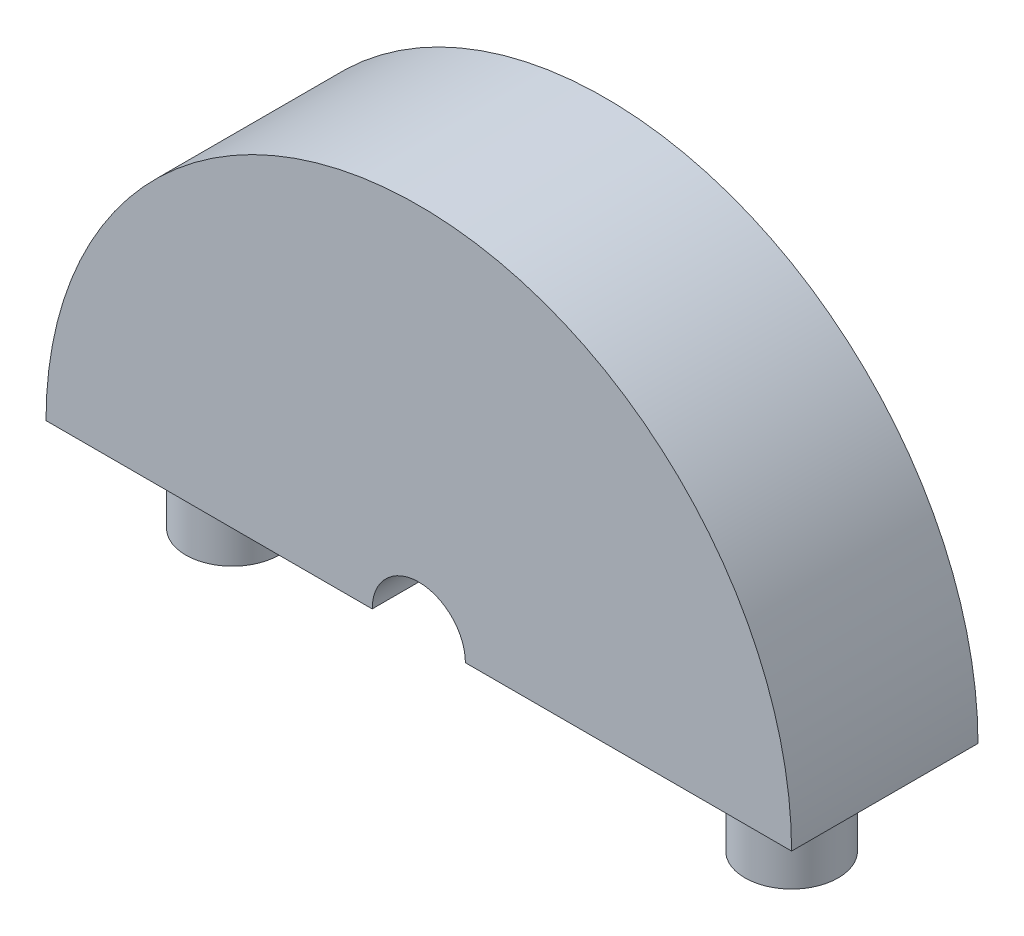
ISO-10303-21;
HEADER;
FILE_DESCRIPTION(('STEP AP214'),'2;1');
FILE_NAME('part.step','',(''),(''),'','','');
FILE_SCHEMA(('AUTOMOTIVE_DESIGN { 1 0 10303 214 1 1 1 1 }'));
ENDSEC;
DATA;
#1=APPLICATION_CONTEXT('core data for automotive mechanical design processes');
#2=APPLICATION_PROTOCOL_DEFINITION('international standard','automotive_design',2000,#1);
#3=PRODUCT_CONTEXT('',#1,'mechanical');
#4=PRODUCT('Part','Part','',(#3));
#5=PRODUCT_RELATED_PRODUCT_CATEGORY('part','',(#4));
#6=PRODUCT_DEFINITION_FORMATION('','',#4);
#7=PRODUCT_DEFINITION_CONTEXT('part definition',#1,'design');
#8=PRODUCT_DEFINITION('design','',#6,#7);
#9=PRODUCT_DEFINITION_SHAPE('','',#8);
#10=(LENGTH_UNIT() NAMED_UNIT(*) SI_UNIT(.MILLI.,.METRE.));
#11=(NAMED_UNIT(*) PLANE_ANGLE_UNIT() SI_UNIT($,.RADIAN.));
#12=(NAMED_UNIT(*) SI_UNIT($,.STERADIAN.) SOLID_ANGLE_UNIT());
#13=UNCERTAINTY_MEASURE_WITH_UNIT(LENGTH_MEASURE(1.E-05),#10,'distance_accuracy_value','');
#14=(GEOMETRIC_REPRESENTATION_CONTEXT(3) GLOBAL_UNCERTAINTY_ASSIGNED_CONTEXT((#13)) GLOBAL_UNIT_ASSIGNED_CONTEXT((#10,
#11,#12)) REPRESENTATION_CONTEXT('',''));
#15=CARTESIAN_POINT('',(0.,0.,0.));
#16=DIRECTION('',(0.,0.,1.));
#17=DIRECTION('',(1.,0.,0.));
#18=AXIS2_PLACEMENT_3D('',#15,#16,#17);
#19=CARTESIAN_POINT('',(20.,0.,10.));
#20=DIRECTION('',(0.,1.,0.));
#21=DIRECTION('',(0.,0.,1.));
#22=AXIS2_PLACEMENT_3D('',#19,#20,#21);
#23=PLANE('',#22);
#24=CARTESIAN_POINT('',(-15.,0.,5.));
#25=DIRECTION('',(0.,1.,0.));
#26=DIRECTION('',(0.,0.,1.));
#27=AXIS2_PLACEMENT_3D('',#24,#25,#26);
#28=CIRCLE('',#27,2.5);
#29=CARTESIAN_POINT('',(-15.,0.,7.5));
#30=VERTEX_POINT('',#29);
#31=EDGE_CURVE('E41',#30,#30,#28,.F.);
#32=ORIENTED_EDGE('',*,*,#31,.F.);
#33=EDGE_LOOP('',(#32));
#34=FACE_BOUND('',#33,.T.);
#35=DIRECTION('',(0.,0.,1.));
#36=VECTOR('',#35,1.);
#37=CARTESIAN_POINT('',(-2.5,0.,17.1339099450869));
#38=LINE('',#37,#36);
#39=CARTESIAN_POINT('',(-2.5,0.,10.));
#40=VERTEX_POINT('',#39);
#41=CARTESIAN_POINT('',(-2.5,0.,0.));
#42=VERTEX_POINT('',#41);
#43=EDGE_CURVE('E48',#40,#42,#38,.F.);
#44=ORIENTED_EDGE('',*,*,#43,.F.);
#45=DIRECTION('',(1.,0.,0.));
#46=VECTOR('',#45,1.);
#47=CARTESIAN_POINT('',(20.,0.,10.));
#48=LINE('',#47,#46);
#49=CARTESIAN_POINT('',(-20.,0.,10.));
#50=VERTEX_POINT('',#49);
#51=EDGE_CURVE('E88',#50,#40,#48,.T.);
#52=ORIENTED_EDGE('',*,*,#51,.F.);
#53=DIRECTION('',(0.,0.,-1.));
#54=VECTOR('',#53,1.);
#55=CARTESIAN_POINT('',(-20.,0.,10.));
#56=LINE('',#55,#54);
#57=CARTESIAN_POINT('',(-20.,0.,0.));
#58=VERTEX_POINT('',#57);
#59=EDGE_CURVE('E87',#50,#58,#56,.T.);
#60=ORIENTED_EDGE('',*,*,#59,.T.);
#61=DIRECTION('',(1.,0.,0.));
#62=VECTOR('',#61,1.);
#63=CARTESIAN_POINT('',(20.,0.,0.));
#64=LINE('',#63,#62);
#65=EDGE_CURVE('E80',#58,#42,#64,.T.);
#66=ORIENTED_EDGE('',*,*,#65,.T.);
#67=EDGE_LOOP('',(#44,#52,#60,#66));
#68=FACE_BOUND('',#67,.T.);
#69=ADVANCED_FACE('F33',(#34,#68),#23,.F.);
#70=CARTESIAN_POINT('',(15.,0.,5.));
#71=DIRECTION('',(0.,1.,0.));
#72=DIRECTION('',(0.,0.,1.));
#73=AXIS2_PLACEMENT_3D('',#70,#71,#72);
#74=CIRCLE('',#73,2.5);
#75=CARTESIAN_POINT('',(15.,0.,7.5));
#76=VERTEX_POINT('',#75);
#77=EDGE_CURVE('E11',#76,#76,#74,.F.);
#78=ORIENTED_EDGE('',*,*,#77,.F.);
#79=EDGE_LOOP('',(#78));
#80=FACE_BOUND('',#79,.T.);
#81=DIRECTION('',(0.,0.,1.));
#82=VECTOR('',#81,1.);
#83=CARTESIAN_POINT('',(2.5,0.,17.1339099450869));
#84=LINE('',#83,#82);
#85=CARTESIAN_POINT('',(2.5,0.,0.));
#86=VERTEX_POINT('',#85);
#87=CARTESIAN_POINT('',(2.5,0.,10.));
#88=VERTEX_POINT('',#87);
#89=EDGE_CURVE('E77',#86,#88,#84,.T.);
#90=ORIENTED_EDGE('',*,*,#89,.F.);
#91=CARTESIAN_POINT('',(20.,0.,0.));
#92=VERTEX_POINT('',#91);
#93=EDGE_CURVE('E71',#86,#92,#64,.T.);
#94=ORIENTED_EDGE('',*,*,#93,.T.);
#95=DIRECTION('',(0.,0.,-1.));
#96=VECTOR('',#95,1.);
#97=CARTESIAN_POINT('',(20.,0.,10.));
#98=LINE('',#97,#96);
#99=CARTESIAN_POINT('',(20.,0.,10.));
#100=VERTEX_POINT('',#99);
#101=EDGE_CURVE('E74',#100,#92,#98,.T.);
#102=ORIENTED_EDGE('',*,*,#101,.F.);
#103=EDGE_CURVE('E57',#88,#100,#48,.T.);
#104=ORIENTED_EDGE('',*,*,#103,.F.);
#105=EDGE_LOOP('',(#90,#94,#102,#104));
#106=FACE_BOUND('',#105,.T.);
#107=ADVANCED_FACE('F73',(#80,#106),#23,.F.);
#108=CARTESIAN_POINT('',(0.,0.,10.));
#109=DIRECTION('',(0.,0.,-1.));
#110=DIRECTION('',(-1.,0.,0.));
#111=AXIS2_PLACEMENT_3D('',#108,#109,#110);
#112=CYLINDRICAL_SURFACE('',#111,20.);
#113=CARTESIAN_POINT('',(0.,0.,0.));
#114=DIRECTION('',(0.,0.,1.));
#115=DIRECTION('',(1.,0.,0.));
#116=AXIS2_PLACEMENT_3D('',#113,#114,#115);
#117=CIRCLE('',#116,20.);
#118=EDGE_CURVE('E81',#92,#58,#117,.T.);
#119=ORIENTED_EDGE('',*,*,#118,.T.);
#120=ORIENTED_EDGE('',*,*,#59,.F.);
#121=CARTESIAN_POINT('',(0.,0.,10.));
#122=DIRECTION('',(0.,0.,1.));
#123=DIRECTION('',(1.,0.,0.));
#124=AXIS2_PLACEMENT_3D('',#121,#122,#123);
#125=CIRCLE('',#124,20.);
#126=EDGE_CURVE('E86',#100,#50,#125,.T.);
#127=ORIENTED_EDGE('',*,*,#126,.F.);
#128=ORIENTED_EDGE('',*,*,#101,.T.);
#129=EDGE_LOOP('',(#119,#120,#127,#128));
#130=FACE_BOUND('',#129,.T.);
#131=ADVANCED_FACE('F35',(#130),#112,.T.);
#132=CARTESIAN_POINT('',(0.,0.,10.));
#133=DIRECTION('',(0.,0.,1.));
#134=DIRECTION('',(1.,0.,0.));
#135=AXIS2_PLACEMENT_3D('',#132,#133,#134);
#136=PLANE('',#135);
#137=ORIENTED_EDGE('',*,*,#51,.T.);
#138=CARTESIAN_POINT('',(0.,0.,10.));
#139=DIRECTION('',(0.,0.,1.));
#140=DIRECTION('',(1.,0.,0.));
#141=AXIS2_PLACEMENT_3D('',#138,#139,#140);
#142=CIRCLE('',#141,2.5);
#143=EDGE_CURVE('E110',#88,#40,#142,.T.);
#144=ORIENTED_EDGE('',*,*,#143,.F.);
#145=ORIENTED_EDGE('',*,*,#103,.T.);
#146=ORIENTED_EDGE('',*,*,#126,.T.);
#147=EDGE_LOOP('',(#137,#144,#145,#146));
#148=FACE_BOUND('',#147,.T.);
#149=ADVANCED_FACE('F109',(#148),#136,.T.);
#150=CARTESIAN_POINT('',(0.,0.,0.));
#151=DIRECTION('',(0.,0.,1.));
#152=DIRECTION('',(1.,0.,0.));
#153=AXIS2_PLACEMENT_3D('',#150,#151,#152);
#154=PLANE('',#153);
#155=CARTESIAN_POINT('',(0.,0.,0.));
#156=DIRECTION('',(0.,0.,1.));
#157=DIRECTION('',(1.,0.,0.));
#158=AXIS2_PLACEMENT_3D('',#155,#156,#157);
#159=CIRCLE('',#158,2.5);
#160=EDGE_CURVE('E114',#86,#42,#159,.T.);
#161=ORIENTED_EDGE('',*,*,#160,.T.);
#162=ORIENTED_EDGE('',*,*,#65,.F.);
#163=ORIENTED_EDGE('',*,*,#118,.F.);
#164=ORIENTED_EDGE('',*,*,#93,.F.);
#165=EDGE_LOOP('',(#161,#162,#163,#164));
#166=FACE_BOUND('',#165,.T.);
#167=ADVANCED_FACE('F90',(#166),#154,.F.);
#168=CARTESIAN_POINT('',(0.,0.,17.1339099450869));
#169=DIRECTION('',(0.,0.,1.));
#170=DIRECTION('',(1.,0.,0.));
#171=AXIS2_PLACEMENT_3D('',#168,#169,#170);
#172=CYLINDRICAL_SURFACE('',#171,2.5);
#173=ORIENTED_EDGE('',*,*,#43,.T.);
#174=ORIENTED_EDGE('',*,*,#160,.F.);
#175=ORIENTED_EDGE('',*,*,#89,.T.);
#176=ORIENTED_EDGE('',*,*,#143,.T.);
#177=EDGE_LOOP('',(#173,#174,#175,#176));
#178=FACE_BOUND('',#177,.T.);
#179=ADVANCED_FACE('F139',(#178),#172,.F.);
#180=CARTESIAN_POINT('',(-15.,-5.,5.));
#181=DIRECTION('',(0.,1.,0.));
#182=DIRECTION('',(0.,0.,1.));
#183=AXIS2_PLACEMENT_3D('',#180,#181,#182);
#184=CYLINDRICAL_SURFACE('',#183,2.5);
#185=CARTESIAN_POINT('',(-15.,-5.,5.));
#186=DIRECTION('',(0.,-1.,0.));
#187=DIRECTION('',(0.,0.,-1.));
#188=AXIS2_PLACEMENT_3D('',#185,#186,#187);
#189=CIRCLE('',#188,2.5);
#190=CARTESIAN_POINT('',(-15.,-5.,2.5));
#191=VERTEX_POINT('',#190);
#192=EDGE_CURVE('E116',#191,#191,#189,.T.);
#193=ORIENTED_EDGE('',*,*,#192,.F.);
#194=EDGE_LOOP('',(#193));
#195=FACE_BOUND('',#194,.T.);
#196=ORIENTED_EDGE('',*,*,#31,.T.);
#197=EDGE_LOOP('',(#196));
#198=FACE_BOUND('',#197,.T.);
#199=ADVANCED_FACE('F101',(#195,#198),#184,.T.);
#200=CARTESIAN_POINT('',(-15.,-5.,5.));
#201=DIRECTION('',(0.,-1.,0.));
#202=DIRECTION('',(0.,0.,-1.));
#203=AXIS2_PLACEMENT_3D('',#200,#201,#202);
#204=PLANE('',#203);
#205=ORIENTED_EDGE('',*,*,#192,.T.);
#206=EDGE_LOOP('',(#205));
#207=FACE_BOUND('',#206,.T.);
#208=ADVANCED_FACE('F128',(#207),#204,.T.);
#209=CARTESIAN_POINT('',(15.,-5.,5.));
#210=DIRECTION('',(0.,1.,0.));
#211=DIRECTION('',(0.,0.,1.));
#212=AXIS2_PLACEMENT_3D('',#209,#210,#211);
#213=CYLINDRICAL_SURFACE('',#212,2.5);
#214=CARTESIAN_POINT('',(15.,-5.,5.));
#215=DIRECTION('',(0.,-1.,0.));
#216=DIRECTION('',(0.,0.,-1.));
#217=AXIS2_PLACEMENT_3D('',#214,#215,#216);
#218=CIRCLE('',#217,2.5);
#219=CARTESIAN_POINT('',(15.,-5.,2.5));
#220=VERTEX_POINT('',#219);
#221=EDGE_CURVE('E119',#220,#220,#218,.T.);
#222=ORIENTED_EDGE('',*,*,#221,.F.);
#223=EDGE_LOOP('',(#222));
#224=FACE_BOUND('',#223,.T.);
#225=ORIENTED_EDGE('',*,*,#77,.T.);
#226=EDGE_LOOP('',(#225));
#227=FACE_BOUND('',#226,.T.);
#228=ADVANCED_FACE('F125',(#224,#227),#213,.T.);
#229=CARTESIAN_POINT('',(15.,-5.,5.));
#230=DIRECTION('',(0.,-1.,0.));
#231=DIRECTION('',(0.,0.,-1.));
#232=AXIS2_PLACEMENT_3D('',#229,#230,#231);
#233=PLANE('',#232);
#234=ORIENTED_EDGE('',*,*,#221,.T.);
#235=EDGE_LOOP('',(#234));
#236=FACE_BOUND('',#235,.T.);
#237=ADVANCED_FACE('F123',(#236),#233,.T.);
#238=CLOSED_SHELL('',(#69,#107,#131,#149,#167,#179,#199,#208,#228,#237));
#239=MANIFOLD_SOLID_BREP('B2',#238);
#240=ADVANCED_BREP_SHAPE_REPRESENTATION('',(#18,#239),#14);
#241=SHAPE_DEFINITION_REPRESENTATION(#9,#240);
ENDSEC;
END-ISO-10303-21;
